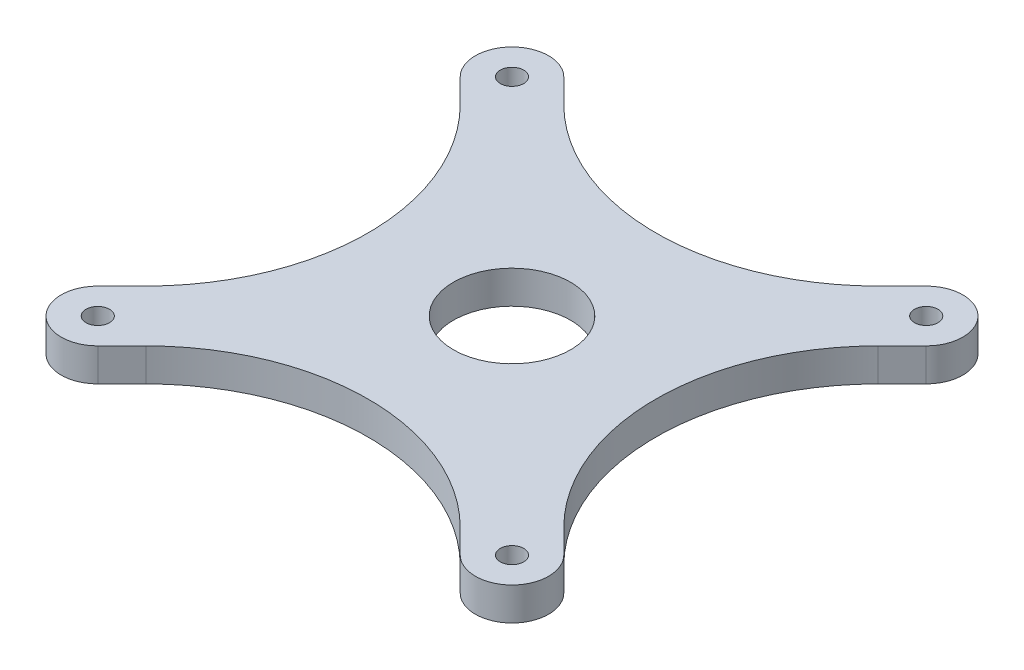
ISO-10303-21;
HEADER;
FILE_DESCRIPTION(('STEP AP214'),'2;1');
FILE_NAME('part.step','',(''),(''),'','','');
FILE_SCHEMA(('AUTOMOTIVE_DESIGN { 1 0 10303 214 1 1 1 1 }'));
ENDSEC;
DATA;
#1=APPLICATION_CONTEXT('core data for automotive mechanical design processes');
#2=APPLICATION_PROTOCOL_DEFINITION('international standard','automotive_design',2000,#1);
#3=PRODUCT_CONTEXT('',#1,'mechanical');
#4=PRODUCT('Part','Part','',(#3));
#5=PRODUCT_RELATED_PRODUCT_CATEGORY('part','',(#4));
#6=PRODUCT_DEFINITION_FORMATION('','',#4);
#7=PRODUCT_DEFINITION_CONTEXT('part definition',#1,'design');
#8=PRODUCT_DEFINITION('design','',#6,#7);
#9=PRODUCT_DEFINITION_SHAPE('','',#8);
#10=(LENGTH_UNIT() NAMED_UNIT(*) SI_UNIT(.MILLI.,.METRE.));
#11=(NAMED_UNIT(*) PLANE_ANGLE_UNIT() SI_UNIT($,.RADIAN.));
#12=(NAMED_UNIT(*) SI_UNIT($,.STERADIAN.) SOLID_ANGLE_UNIT());
#13=UNCERTAINTY_MEASURE_WITH_UNIT(LENGTH_MEASURE(1.E-05),#10,'distance_accuracy_value','');
#14=(GEOMETRIC_REPRESENTATION_CONTEXT(3) GLOBAL_UNCERTAINTY_ASSIGNED_CONTEXT((#13)) GLOBAL_UNIT_ASSIGNED_CONTEXT((#10,
#11,#12)) REPRESENTATION_CONTEXT('',''));
#15=CARTESIAN_POINT('',(0.,0.,0.));
#16=DIRECTION('',(0.,0.,1.));
#17=DIRECTION('',(1.,0.,0.));
#18=AXIS2_PLACEMENT_3D('',#15,#16,#17);
#19=CARTESIAN_POINT('',(-34.9999999999997,5.001,27.9289321881349));
#20=DIRECTION('',(0.707106781186555,0.,0.70710678118654));
#21=DIRECTION('',(0.70710678118654,0.,-0.707106781186555));
#22=AXIS2_PLACEMENT_3D('',#19,#20,#21);
#23=PLANE('',#22);
#24=DIRECTION('',(0.,-1.,0.));
#25=VECTOR('',#24,1.);
#26=CARTESIAN_POINT('',(-28.5355339059325,50.838310227381,21.4644660940676));
#27=LINE('',#26,#25);
#28=CARTESIAN_POINT('',(-28.5355339059325,5.,21.4644660940676));
#29=VERTEX_POINT('',#28);
#30=CARTESIAN_POINT('',(-28.5355339059325,0.5,21.4644660940676));
#31=VERTEX_POINT('',#30);
#32=EDGE_CURVE('E166',#29,#31,#27,.T.);
#33=ORIENTED_EDGE('',*,*,#32,.T.);
#34=DIRECTION('',(-0.70710678118654,0.,0.707106781186555));
#35=VECTOR('',#34,1.);
#36=CARTESIAN_POINT('',(-34.9999999999997,0.5,27.9289321881349));
#37=LINE('',#36,#35);
#38=CARTESIAN_POINT('',(-31.8198051534006,0.5,24.7487373415232));
#39=VERTEX_POINT('',#38);
#40=EDGE_CURVE('E175',#31,#39,#37,.T.);
#41=ORIENTED_EDGE('',*,*,#40,.T.);
#42=DIRECTION('',(0.,-1.,0.));
#43=VECTOR('',#42,1.);
#44=CARTESIAN_POINT('',(-31.8198051534006,5.001,24.7487373415232));
#45=LINE('',#44,#43);
#46=CARTESIAN_POINT('',(-31.8198051534006,5.,24.7487373415358));
#47=VERTEX_POINT('',#46);
#48=EDGE_CURVE('E392',#47,#39,#45,.T.);
#49=ORIENTED_EDGE('',*,*,#48,.F.);
#50=DIRECTION('',(0.70710678118654,0.,-0.707106781186555));
#51=VECTOR('',#50,1.);
#52=CARTESIAN_POINT('',(-34.9999999999997,5.,27.9289321881349));
#53=LINE('',#52,#51);
#54=EDGE_CURVE('E182',#47,#29,#53,.T.);
#55=ORIENTED_EDGE('',*,*,#54,.T.);
#56=EDGE_LOOP('',(#33,#41,#49,#55));
#57=FACE_BOUND('',#56,.T.);
#58=ADVANCED_FACE('F38',(#57),#23,.F.);
#59=CARTESIAN_POINT('',(-27.9289321881348,5.001,-34.9999999999998));
#60=DIRECTION('',(-0.707106781186543,0.,0.707106781186552));
#61=DIRECTION('',(0.707106781186552,0.,0.707106781186543));
#62=AXIS2_PLACEMENT_3D('',#59,#60,#61);
#63=PLANE('',#62);
#64=DIRECTION('',(0.,-1.,0.));
#65=VECTOR('',#64,1.);
#66=CARTESIAN_POINT('',(-21.4644660940675,50.838310227381,-28.5355339059326));
#67=LINE('',#66,#65);
#68=CARTESIAN_POINT('',(-21.4644660940675,5.,-28.5355339059326));
#69=VERTEX_POINT('',#68);
#70=CARTESIAN_POINT('',(-21.4644660940675,0.5,-28.5355339059326));
#71=VERTEX_POINT('',#70);
#72=EDGE_CURVE('E350',#69,#71,#67,.T.);
#73=ORIENTED_EDGE('',*,*,#72,.T.);
#74=DIRECTION('',(-0.707106781186553,0.,-0.707106781186543));
#75=VECTOR('',#74,1.);
#76=CARTESIAN_POINT('',(-27.9289321881348,0.5,-34.9999999999998));
#77=LINE('',#76,#75);
#78=CARTESIAN_POINT('',(-24.7487373415293,0.5,-31.8198051533945));
#79=VERTEX_POINT('',#78);
#80=EDGE_CURVE('E196',#71,#79,#77,.T.);
#81=ORIENTED_EDGE('',*,*,#80,.T.);
#82=DIRECTION('',(0.,-1.,0.));
#83=VECTOR('',#82,1.);
#84=CARTESIAN_POINT('',(-24.7487373415293,5.001,-31.8198051533945));
#85=LINE('',#84,#83);
#86=CARTESIAN_POINT('',(-24.7487373415293,5.,-31.8198051533945));
#87=VERTEX_POINT('',#86);
#88=EDGE_CURVE('E404',#87,#79,#85,.T.);
#89=ORIENTED_EDGE('',*,*,#88,.F.);
#90=DIRECTION('',(0.707106781186552,0.,0.707106781186543));
#91=VECTOR('',#90,1.);
#92=CARTESIAN_POINT('',(-27.9289321881348,5.,-34.9999999999998));
#93=LINE('',#92,#91);
#94=EDGE_CURVE('E203',#87,#69,#93,.T.);
#95=ORIENTED_EDGE('',*,*,#94,.T.);
#96=EDGE_LOOP('',(#73,#81,#89,#95));
#97=FACE_BOUND('',#96,.T.);
#98=ADVANCED_FACE('F282',(#97),#63,.F.);
#99=CARTESIAN_POINT('',(34.9999999999999,5.001,-27.9289321881347));
#100=DIRECTION('',(-0.70710678118655,0.,-0.707106781186545));
#101=DIRECTION('',(-0.707106781186545,0.,0.70710678118655));
#102=AXIS2_PLACEMENT_3D('',#99,#100,#101);
#103=PLANE('',#102);
#104=DIRECTION('',(0.,-1.,0.));
#105=VECTOR('',#104,1.);
#106=CARTESIAN_POINT('',(28.5355339059327,50.838310227381,-21.4644660940674));
#107=LINE('',#106,#105);
#108=CARTESIAN_POINT('',(28.5355339059327,5.,-21.4644660940674));
#109=VERTEX_POINT('',#108);
#110=CARTESIAN_POINT('',(28.5355339059327,0.5,-21.4644660940674));
#111=VERTEX_POINT('',#110);
#112=EDGE_CURVE('E364',#109,#111,#107,.T.);
#113=ORIENTED_EDGE('',*,*,#112,.T.);
#114=DIRECTION('',(0.707106781186545,0.,-0.70710678118655));
#115=VECTOR('',#114,1.);
#116=CARTESIAN_POINT('',(34.9999999999999,0.5,-27.9289321881347));
#117=LINE('',#116,#115);
#118=CARTESIAN_POINT('',(31.8198051534066,0.5,-24.7487373415253));
#119=VERTEX_POINT('',#118);
#120=EDGE_CURVE('E210',#111,#119,#117,.T.);
#121=ORIENTED_EDGE('',*,*,#120,.T.);
#122=DIRECTION('',(0.,-1.,0.));
#123=VECTOR('',#122,1.);
#124=CARTESIAN_POINT('',(31.8198051534066,5.001,-24.7487373415253));
#125=LINE('',#124,#123);
#126=CARTESIAN_POINT('',(31.8198051534066,5.,-24.7487373415253));
#127=VERTEX_POINT('',#126);
#128=EDGE_CURVE('E415',#127,#119,#125,.T.);
#129=ORIENTED_EDGE('',*,*,#128,.F.);
#130=DIRECTION('',(-0.707106781186545,0.,0.70710678118655));
#131=VECTOR('',#130,1.);
#132=CARTESIAN_POINT('',(34.9999999999999,5.,-27.9289321881347));
#133=LINE('',#132,#131);
#134=EDGE_CURVE('E217',#127,#109,#133,.T.);
#135=ORIENTED_EDGE('',*,*,#134,.T.);
#136=EDGE_LOOP('',(#113,#121,#129,#135));
#137=FACE_BOUND('',#136,.T.);
#138=ADVANCED_FACE('F288',(#137),#103,.F.);
#139=CARTESIAN_POINT('',(27.9289321881345,5.001,35.));
#140=DIRECTION('',(0.707106781186547,0.,-0.707106781186547));
#141=DIRECTION('',(-0.707106781186548,0.,-0.707106781186548));
#142=AXIS2_PLACEMENT_3D('',#139,#140,#141);
#143=PLANE('',#142);
#144=DIRECTION('',(0.,-1.,0.));
#145=VECTOR('',#144,1.);
#146=CARTESIAN_POINT('',(21.4644660940673,50.838310227381,28.5355339059327));
#147=LINE('',#146,#145);
#148=CARTESIAN_POINT('',(21.4644660940673,5.,28.5355339059327));
#149=VERTEX_POINT('',#148);
#150=CARTESIAN_POINT('',(21.4644660940673,0.5,28.5355339059327));
#151=VERTEX_POINT('',#150);
#152=EDGE_CURVE('E377',#149,#151,#147,.T.);
#153=ORIENTED_EDGE('',*,*,#152,.T.);
#154=DIRECTION('',(0.707106781186548,0.,0.707106781186548));
#155=VECTOR('',#154,1.);
#156=CARTESIAN_POINT('',(27.9289321881345,0.5,35.));
#157=LINE('',#156,#155);
#158=CARTESIAN_POINT('',(24.7487373415292,0.5,31.8198051533946));
#159=VERTEX_POINT('',#158);
#160=EDGE_CURVE('E224',#151,#159,#157,.T.);
#161=ORIENTED_EDGE('',*,*,#160,.T.);
#162=DIRECTION('',(0.,-1.,0.));
#163=VECTOR('',#162,1.);
#164=CARTESIAN_POINT('',(24.7487373415292,5.001,31.8198051533946));
#165=LINE('',#164,#163);
#166=CARTESIAN_POINT('',(24.7487373415292,5.,31.8198051533946));
#167=VERTEX_POINT('',#166);
#168=EDGE_CURVE('E429',#167,#159,#165,.T.);
#169=ORIENTED_EDGE('',*,*,#168,.F.);
#170=DIRECTION('',(-0.707106781186548,0.,-0.707106781186548));
#171=VECTOR('',#170,1.);
#172=CARTESIAN_POINT('',(27.9289321881345,5.,35.));
#173=LINE('',#172,#171);
#174=EDGE_CURVE('E231',#167,#149,#173,.T.);
#175=ORIENTED_EDGE('',*,*,#174,.T.);
#176=EDGE_LOOP('',(#153,#161,#169,#175));
#177=FACE_BOUND('',#176,.T.);
#178=ADVANCED_FACE('F304',(#177),#143,.F.);
#179=CARTESIAN_POINT('',(-27.9289321881345,5.001,35.));
#180=DIRECTION('',(-0.707106781186547,0.,-0.707106781186547));
#181=DIRECTION('',(-0.707106781186548,0.,0.707106781186548));
#182=AXIS2_PLACEMENT_3D('',#179,#180,#181);
#183=PLANE('',#182);
#184=DIRECTION('',(0.707106781186548,0.,-0.707106781186548));
#185=VECTOR('',#184,1.);
#186=CARTESIAN_POINT('',(-27.9289321881345,0.5,35.));
#187=LINE('',#186,#185);
#188=CARTESIAN_POINT('',(-24.748737341521,0.5,31.8198051533947));
#189=VERTEX_POINT('',#188);
#190=CARTESIAN_POINT('',(-21.4644660940693,0.5,28.5355339059415));
#191=VERTEX_POINT('',#190);
#192=EDGE_CURVE('E227',#189,#191,#187,.T.);
#193=ORIENTED_EDGE('',*,*,#192,.T.);
#194=DIRECTION('',(0.,-1.,0.));
#195=VECTOR('',#194,1.);
#196=CARTESIAN_POINT('',(-21.4644660940693,50.838310227381,28.5355339059415));
#197=LINE('',#196,#195);
#198=CARTESIAN_POINT('',(-21.4644660940693,5.,28.5355339059415));
#199=VERTEX_POINT('',#198);
#200=EDGE_CURVE('E381',#199,#191,#197,.T.);
#201=ORIENTED_EDGE('',*,*,#200,.F.);
#202=DIRECTION('',(-0.707106781186548,0.,0.707106781186548));
#203=VECTOR('',#202,1.);
#204=CARTESIAN_POINT('',(-27.9289321881345,5.,35.));
#205=LINE('',#204,#203);
#206=CARTESIAN_POINT('',(-24.748737341521,5.,31.8198051533947));
#207=VERTEX_POINT('',#206);
#208=EDGE_CURVE('E221',#199,#207,#205,.T.);
#209=ORIENTED_EDGE('',*,*,#208,.T.);
#210=DIRECTION('',(0.,-1.,0.));
#211=VECTOR('',#210,1.);
#212=CARTESIAN_POINT('',(-24.748737341521,5.001,31.8198051533947));
#213=LINE('',#212,#211);
#214=EDGE_CURVE('E393',#207,#189,#213,.T.);
#215=ORIENTED_EDGE('',*,*,#214,.T.);
#216=EDGE_LOOP('',(#193,#201,#209,#215));
#217=FACE_BOUND('',#216,.T.);
#218=ADVANCED_FACE('F306',(#217),#183,.F.);
#219=CARTESIAN_POINT('',(-35.0000000000003,5.001,-27.9289321881342));
#220=DIRECTION('',(0.70710678118654,0.,-0.707106781186555));
#221=DIRECTION('',(-0.707106781186555,0.,-0.70710678118654));
#222=AXIS2_PLACEMENT_3D('',#219,#220,#221);
#223=PLANE('',#222);
#224=DIRECTION('',(0.707106781186555,0.,0.70710678118654));
#225=VECTOR('',#224,1.);
#226=CARTESIAN_POINT('',(-35.0000000000003,0.5,-27.9289321881342));
#227=LINE('',#226,#225);
#228=CARTESIAN_POINT('',(-31.8198051533949,0.5,-24.7487373415288));
#229=VERTEX_POINT('',#228);
#230=CARTESIAN_POINT('',(-28.5355339059417,0.5,-21.4644660940691));
#231=VERTEX_POINT('',#230);
#232=EDGE_CURVE('E173',#229,#231,#227,.T.);
#233=ORIENTED_EDGE('',*,*,#232,.T.);
#234=DIRECTION('',(0.,-1.,0.));
#235=VECTOR('',#234,1.);
#236=CARTESIAN_POINT('',(-28.5355339059417,50.838310227381,-21.4644660940691));
#237=LINE('',#236,#235);
#238=CARTESIAN_POINT('',(-28.5355339059417,5.,-21.4644660940691));
#239=VERTEX_POINT('',#238);
#240=EDGE_CURVE('E155',#239,#231,#237,.T.);
#241=ORIENTED_EDGE('',*,*,#240,.F.);
#242=DIRECTION('',(-0.707106781186555,0.,-0.70710678118654));
#243=VECTOR('',#242,1.);
#244=CARTESIAN_POINT('',(-35.0000000000003,5.,-27.9289321881342));
#245=LINE('',#244,#243);
#246=CARTESIAN_POINT('',(-31.8198051533949,5.,-24.7487373415288));
#247=VERTEX_POINT('',#246);
#248=EDGE_CURVE('E190',#239,#247,#245,.T.);
#249=ORIENTED_EDGE('',*,*,#248,.T.);
#250=DIRECTION('',(0.,-1.,0.));
#251=VECTOR('',#250,1.);
#252=CARTESIAN_POINT('',(-31.8198051533949,5.001,-24.7487373415288));
#253=LINE('',#252,#251);
#254=EDGE_CURVE('E180',#247,#229,#253,.T.);
#255=ORIENTED_EDGE('',*,*,#254,.T.);
#256=EDGE_LOOP('',(#233,#241,#249,#255));
#257=FACE_BOUND('',#256,.T.);
#258=ADVANCED_FACE('F179',(#257),#223,.F.);
#259=CARTESIAN_POINT('',(27.9289321881343,5.001,-35.0000000000002));
#260=DIRECTION('',(0.707106781186552,0.,0.707106781186543));
#261=DIRECTION('',(0.707106781186543,0.,-0.707106781186552));
#262=AXIS2_PLACEMENT_3D('',#259,#260,#261);
#263=PLANE('',#262);
#264=DIRECTION('',(-0.707106781186543,0.,0.707106781186552));
#265=VECTOR('',#264,1.);
#266=CARTESIAN_POINT('',(27.9289321881343,0.5,-35.0000000000002));
#267=LINE('',#266,#265);
#268=CARTESIAN_POINT('',(24.7487373415286,0.5,-31.8198051533945));
#269=VERTEX_POINT('',#268);
#270=CARTESIAN_POINT('',(21.4644660940692,0.5,-28.5355339059416));
#271=VERTEX_POINT('',#270);
#272=EDGE_CURVE('E199',#269,#271,#267,.T.);
#273=ORIENTED_EDGE('',*,*,#272,.T.);
#274=DIRECTION('',(0.,-1.,0.));
#275=VECTOR('',#274,1.);
#276=CARTESIAN_POINT('',(21.4644660940692,50.838310227381,-28.5355339059416));
#277=LINE('',#276,#275);
#278=CARTESIAN_POINT('',(21.4644660940692,5.,-28.5355339059416));
#279=VERTEX_POINT('',#278);
#280=EDGE_CURVE('E354',#279,#271,#277,.T.);
#281=ORIENTED_EDGE('',*,*,#280,.F.);
#282=DIRECTION('',(0.707106781186543,0.,-0.707106781186552));
#283=VECTOR('',#282,1.);
#284=CARTESIAN_POINT('',(27.9289321881343,5.,-35.0000000000002));
#285=LINE('',#284,#283);
#286=CARTESIAN_POINT('',(24.7487373415286,5.,-31.8198051534028));
#287=VERTEX_POINT('',#286);
#288=EDGE_CURVE('E187',#279,#287,#285,.T.);
#289=ORIENTED_EDGE('',*,*,#288,.T.);
#290=DIRECTION('',(0.,-1.,0.));
#291=VECTOR('',#290,1.);
#292=CARTESIAN_POINT('',(24.7487373415286,5.001,-31.8198051534028));
#293=LINE('',#292,#291);
#294=EDGE_CURVE('E416',#287,#269,#293,.T.);
#295=ORIENTED_EDGE('',*,*,#294,.T.);
#296=EDGE_LOOP('',(#273,#281,#289,#295));
#297=FACE_BOUND('',#296,.T.);
#298=ADVANCED_FACE('F294',(#297),#263,.F.);
#299=CARTESIAN_POINT('',(35.0000000000001,5.001,27.9289321881344));
#300=DIRECTION('',(-0.707106781186545,0.,0.70710678118655));
#301=DIRECTION('',(0.70710678118655,0.,0.707106781186545));
#302=AXIS2_PLACEMENT_3D('',#299,#300,#301);
#303=PLANE('',#302);
#304=DIRECTION('',(-0.70710678118655,0.,-0.707106781186545));
#305=VECTOR('',#304,1.);
#306=CARTESIAN_POINT('',(35.0000000000001,0.5,27.9289321881344));
#307=LINE('',#306,#305);
#308=CARTESIAN_POINT('',(31.8198051533905,0.5,24.7487373415249));
#309=VERTEX_POINT('',#308);
#310=CARTESIAN_POINT('',(28.5355339059415,0.5,21.4644660940693));
#311=VERTEX_POINT('',#310);
#312=EDGE_CURVE('E213',#309,#311,#307,.T.);
#313=ORIENTED_EDGE('',*,*,#312,.T.);
#314=DIRECTION('',(0.,-1.,0.));
#315=VECTOR('',#314,1.);
#316=CARTESIAN_POINT('',(28.5355339059415,50.838310227381,21.4644660940693));
#317=LINE('',#316,#315);
#318=CARTESIAN_POINT('',(28.5355339059415,5.,21.4644660940693));
#319=VERTEX_POINT('',#318);
#320=EDGE_CURVE('E368',#319,#311,#317,.T.);
#321=ORIENTED_EDGE('',*,*,#320,.F.);
#322=DIRECTION('',(0.70710678118655,0.,0.707106781186545));
#323=VECTOR('',#322,1.);
#324=CARTESIAN_POINT('',(35.0000000000001,5.,27.9289321881344));
#325=LINE('',#324,#323);
#326=CARTESIAN_POINT('',(31.8198051533985,5.,24.7487373415249));
#327=VERTEX_POINT('',#326);
#328=EDGE_CURVE('E207',#319,#327,#325,.T.);
#329=ORIENTED_EDGE('',*,*,#328,.T.);
#330=DIRECTION('',(0.,-1.,0.));
#331=VECTOR('',#330,1.);
#332=CARTESIAN_POINT('',(31.8198051533985,5.001,24.7487373415249));
#333=LINE('',#332,#331);
#334=EDGE_CURVE('E430',#327,#309,#333,.T.);
#335=ORIENTED_EDGE('',*,*,#334,.T.);
#336=EDGE_LOOP('',(#313,#321,#329,#335));
#337=FACE_BOUND('',#336,.T.);
#338=ADVANCED_FACE('F296',(#337),#303,.F.);
#339=CARTESIAN_POINT('',(0.,5.,0.));
#340=DIRECTION('',(0.,-1.,0.));
#341=DIRECTION('',(0.,0.,-1.));
#342=AXIS2_PLACEMENT_3D('',#339,#340,#341);
#343=PLANE('',#342);
#344=ORIENTED_EDGE('',*,*,#248,.F.);
#345=CARTESIAN_POINT('',(-50.,5.,5.21987477350493E-13));
#346=DIRECTION('',(0.,-1.,0.));
#347=DIRECTION('',(0.,0.,-1.));
#348=AXIS2_PLACEMENT_3D('',#345,#346,#347);
#349=CIRCLE('',#348,30.355339059325);
#350=EDGE_CURVE('E161',#239,#29,#349,.T.);
#351=ORIENTED_EDGE('',*,*,#350,.T.);
#352=ORIENTED_EDGE('',*,*,#54,.F.);
#353=CARTESIAN_POINT('',(-28.2842712474621,5.,28.284271247454));
#354=DIRECTION('',(0.,-1.,0.));
#355=DIRECTION('',(0.,0.,-1.));
#356=AXIS2_PLACEMENT_3D('',#353,#354,#355);
#357=CIRCLE('',#356,5.00000000000272);
#358=EDGE_CURVE('E54',#207,#47,#357,.T.);
#359=ORIENTED_EDGE('',*,*,#358,.F.);
#360=ORIENTED_EDGE('',*,*,#208,.F.);
#361=CARTESIAN_POINT('',(0.,5.,50.));
#362=DIRECTION('',(0.,-1.,0.));
#363=DIRECTION('',(0.,0.,-1.));
#364=AXIS2_PLACEMENT_3D('',#361,#362,#363);
#365=CIRCLE('',#364,30.355339059325);
#366=EDGE_CURVE('E374',#199,#149,#365,.T.);
#367=ORIENTED_EDGE('',*,*,#366,.T.);
#368=ORIENTED_EDGE('',*,*,#174,.F.);
#369=CARTESIAN_POINT('',(28.2842712474619,5.,28.2842712474619));
#370=DIRECTION('',(0.,-1.,0.));
#371=DIRECTION('',(0.,0.,-1.));
#372=AXIS2_PLACEMENT_3D('',#369,#370,#371);
#373=CIRCLE('',#372,5.00000000000578);
#374=EDGE_CURVE('E420',#327,#167,#373,.T.);
#375=ORIENTED_EDGE('',*,*,#374,.F.);
#376=ORIENTED_EDGE('',*,*,#328,.F.);
#377=CARTESIAN_POINT('',(50.,5.,-1.74574066942157E-13));
#378=DIRECTION('',(0.,-1.,0.));
#379=DIRECTION('',(0.,0.,-1.));
#380=AXIS2_PLACEMENT_3D('',#377,#378,#379);
#381=CIRCLE('',#380,30.355339059325);
#382=EDGE_CURVE('E360',#319,#109,#381,.T.);
#383=ORIENTED_EDGE('',*,*,#382,.T.);
#384=ORIENTED_EDGE('',*,*,#134,.F.);
#385=CARTESIAN_POINT('',(28.2842712474697,5.,-28.2842712474621));
#386=DIRECTION('',(0.,-1.,0.));
#387=DIRECTION('',(0.,0.,-1.));
#388=AXIS2_PLACEMENT_3D('',#385,#386,#387);
#389=CIRCLE('',#388,5.00000000000578);
#390=EDGE_CURVE('E407',#287,#127,#389,.T.);
#391=ORIENTED_EDGE('',*,*,#390,.F.);
#392=ORIENTED_EDGE('',*,*,#288,.F.);
#393=CARTESIAN_POINT('',(-3.49148133884313E-13,5.,-50.));
#394=DIRECTION('',(0.,-1.,0.));
#395=DIRECTION('',(0.,0.,-1.));
#396=AXIS2_PLACEMENT_3D('',#393,#394,#395);
#397=CIRCLE('',#396,30.355339059325);
#398=EDGE_CURVE('E346',#279,#69,#397,.T.);
#399=ORIENTED_EDGE('',*,*,#398,.T.);
#400=ORIENTED_EDGE('',*,*,#94,.F.);
#401=CARTESIAN_POINT('',(-28.2842712474621,5.,-28.2842712474617));
#402=DIRECTION('',(0.,-1.,0.));
#403=DIRECTION('',(0.,0.,-1.));
#404=AXIS2_PLACEMENT_3D('',#401,#402,#403);
#405=CIRCLE('',#404,5.00000000000007);
#406=EDGE_CURVE('E397',#247,#87,#405,.T.);
#407=ORIENTED_EDGE('',*,*,#406,.F.);
#408=EDGE_LOOP('',(#344,#351,#352,#359,#360,#367,#368,#375,#376,#383,#384,#391,#392,#399,#400,#407));
#409=FACE_BOUND('',#408,.T.);
#410=CARTESIAN_POINT('',(28.2842712474619,5.,-28.2842712474619));
#411=DIRECTION('',(0.,1.,0.));
#412=DIRECTION('',(0.,0.,1.));
#413=AXIS2_PLACEMENT_3D('',#410,#411,#412);
#414=CIRCLE('',#413,1.6);
#415=CARTESIAN_POINT('',(28.2842712474619,5.,-26.6842712474619));
#416=VERTEX_POINT('',#415);
#417=EDGE_CURVE('E235',#416,#416,#414,.T.);
#418=ORIENTED_EDGE('',*,*,#417,.F.);
#419=EDGE_LOOP('',(#418));
#420=FACE_BOUND('',#419,.T.);
#421=CARTESIAN_POINT('',(-28.2842712474619,5.,-28.2842712474619));
#422=DIRECTION('',(0.,1.,0.));
#423=DIRECTION('',(0.,0.,1.));
#424=AXIS2_PLACEMENT_3D('',#421,#422,#423);
#425=CIRCLE('',#424,1.6);
#426=CARTESIAN_POINT('',(-28.2842712474619,5.,-26.6842712474619));
#427=VERTEX_POINT('',#426);
#428=EDGE_CURVE('E243',#427,#427,#425,.T.);
#429=ORIENTED_EDGE('',*,*,#428,.F.);
#430=EDGE_LOOP('',(#429));
#431=FACE_BOUND('',#430,.T.);
#432=CARTESIAN_POINT('',(-28.2842712474619,5.,28.2842712474619));
#433=DIRECTION('',(0.,1.,0.));
#434=DIRECTION('',(0.,0.,1.));
#435=AXIS2_PLACEMENT_3D('',#432,#433,#434);
#436=CIRCLE('',#435,1.6);
#437=CARTESIAN_POINT('',(-28.2842712474619,5.,29.8842712474619));
#438=VERTEX_POINT('',#437);
#439=EDGE_CURVE('E251',#438,#438,#436,.T.);
#440=ORIENTED_EDGE('',*,*,#439,.F.);
#441=EDGE_LOOP('',(#440));
#442=FACE_BOUND('',#441,.T.);
#443=CARTESIAN_POINT('',(28.2842712474619,5.,28.2842712474619));
#444=DIRECTION('',(0.,1.,0.));
#445=DIRECTION('',(0.,0.,1.));
#446=AXIS2_PLACEMENT_3D('',#443,#444,#445);
#447=CIRCLE('',#446,1.6);
#448=CARTESIAN_POINT('',(28.2842712474619,5.,29.8842712474619));
#449=VERTEX_POINT('',#448);
#450=EDGE_CURVE('E259',#449,#449,#447,.T.);
#451=ORIENTED_EDGE('',*,*,#450,.F.);
#452=EDGE_LOOP('',(#451));
#453=FACE_BOUND('',#452,.T.);
#454=CARTESIAN_POINT('',(0.,5.,0.));
#455=DIRECTION('',(0.,1.,0.));
#456=DIRECTION('',(0.,0.,1.));
#457=AXIS2_PLACEMENT_3D('',#454,#455,#456);
#458=CIRCLE('',#457,8.);
#459=CARTESIAN_POINT('',(0.,5.,8.));
#460=VERTEX_POINT('',#459);
#461=EDGE_CURVE('E11',#460,#460,#458,.T.);
#462=ORIENTED_EDGE('',*,*,#461,.F.);
#463=EDGE_LOOP('',(#462));
#464=FACE_BOUND('',#463,.T.);
#465=ADVANCED_FACE('F40',(#409,#420,#431,#442,#453,#464),#343,.F.);
#466=CARTESIAN_POINT('',(0.,2.5,0.));
#467=DIRECTION('',(0.,1.,0.));
#468=DIRECTION('',(0.,0.,1.));
#469=AXIS2_PLACEMENT_3D('',#466,#467,#468);
#470=CYLINDRICAL_SURFACE('',#469,8.);
#471=ORIENTED_EDGE('',*,*,#461,.T.);
#472=EDGE_LOOP('',(#471));
#473=FACE_BOUND('',#472,.T.);
#474=CARTESIAN_POINT('',(0.,0.5,0.));
#475=DIRECTION('',(0.,1.,0.));
#476=DIRECTION('',(0.,0.,1.));
#477=AXIS2_PLACEMENT_3D('',#474,#475,#476);
#478=CIRCLE('',#477,8.);
#479=CARTESIAN_POINT('',(0.,0.5,8.));
#480=VERTEX_POINT('',#479);
#481=EDGE_CURVE('E177',#480,#480,#478,.F.);
#482=ORIENTED_EDGE('',*,*,#481,.T.);
#483=EDGE_LOOP('',(#482));
#484=FACE_BOUND('',#483,.T.);
#485=ADVANCED_FACE('F269',(#473,#484),#470,.F.);
#486=CARTESIAN_POINT('',(0.,0.5,0.));
#487=DIRECTION('',(0.,1.,0.));
#488=DIRECTION('',(0.,0.,1.));
#489=AXIS2_PLACEMENT_3D('',#486,#487,#488);
#490=PLANE('',#489);
#491=ORIENTED_EDGE('',*,*,#481,.F.);
#492=EDGE_LOOP('',(#491));
#493=FACE_BOUND('',#492,.T.);
#494=ORIENTED_EDGE('',*,*,#40,.F.);
#495=CARTESIAN_POINT('',(-50.,0.5,5.21987477350493E-13));
#496=DIRECTION('',(0.,1.,0.));
#497=DIRECTION('',(0.,0.,-1.));
#498=AXIS2_PLACEMENT_3D('',#495,#496,#497);
#499=CIRCLE('',#498,30.355339059325);
#500=EDGE_CURVE('E159',#31,#231,#499,.T.);
#501=ORIENTED_EDGE('',*,*,#500,.T.);
#502=ORIENTED_EDGE('',*,*,#232,.F.);
#503=CARTESIAN_POINT('',(-28.2842712474621,0.5,-28.2842712474617));
#504=DIRECTION('',(0.,1.,0.));
#505=DIRECTION('',(0.,0.,-1.));
#506=AXIS2_PLACEMENT_3D('',#503,#504,#505);
#507=CIRCLE('',#506,5.00000000000007);
#508=EDGE_CURVE('E62',#79,#229,#507,.T.);
#509=ORIENTED_EDGE('',*,*,#508,.F.);
#510=ORIENTED_EDGE('',*,*,#80,.F.);
#511=CARTESIAN_POINT('',(-3.49148133884313E-13,0.5,-50.));
#512=DIRECTION('',(0.,1.,0.));
#513=DIRECTION('',(0.,0.,-1.));
#514=AXIS2_PLACEMENT_3D('',#511,#512,#513);
#515=CIRCLE('',#514,30.355339059325);
#516=EDGE_CURVE('E342',#71,#271,#515,.T.);
#517=ORIENTED_EDGE('',*,*,#516,.T.);
#518=ORIENTED_EDGE('',*,*,#272,.F.);
#519=CARTESIAN_POINT('',(28.2842712474697,0.5,-28.2842712474621));
#520=DIRECTION('',(0.,1.,0.));
#521=DIRECTION('',(0.,0.,-1.));
#522=AXIS2_PLACEMENT_3D('',#519,#520,#521);
#523=CIRCLE('',#522,5.00000000000578);
#524=EDGE_CURVE('E412',#119,#269,#523,.T.);
#525=ORIENTED_EDGE('',*,*,#524,.F.);
#526=ORIENTED_EDGE('',*,*,#120,.F.);
#527=CARTESIAN_POINT('',(50.,0.5,-1.74574066942157E-13));
#528=DIRECTION('',(0.,1.,0.));
#529=DIRECTION('',(0.,0.,-1.));
#530=AXIS2_PLACEMENT_3D('',#527,#528,#529);
#531=CIRCLE('',#530,30.355339059325);
#532=EDGE_CURVE('E349',#111,#311,#531,.T.);
#533=ORIENTED_EDGE('',*,*,#532,.T.);
#534=ORIENTED_EDGE('',*,*,#312,.F.);
#535=CARTESIAN_POINT('',(28.2842712474619,0.5,28.2842712474619));
#536=DIRECTION('',(0.,1.,0.));
#537=DIRECTION('',(0.,0.,-1.));
#538=AXIS2_PLACEMENT_3D('',#535,#536,#537);
#539=CIRCLE('',#538,5.00000000000578);
#540=EDGE_CURVE('E426',#159,#309,#539,.T.);
#541=ORIENTED_EDGE('',*,*,#540,.F.);
#542=ORIENTED_EDGE('',*,*,#160,.F.);
#543=CARTESIAN_POINT('',(0.,0.5,50.));
#544=DIRECTION('',(0.,1.,0.));
#545=DIRECTION('',(0.,0.,-1.));
#546=AXIS2_PLACEMENT_3D('',#543,#544,#545);
#547=CIRCLE('',#546,30.355339059325);
#548=EDGE_CURVE('E363',#151,#191,#547,.T.);
#549=ORIENTED_EDGE('',*,*,#548,.T.);
#550=ORIENTED_EDGE('',*,*,#192,.F.);
#551=CARTESIAN_POINT('',(-28.2842712474621,0.5,28.284271247454));
#552=DIRECTION('',(0.,1.,0.));
#553=DIRECTION('',(0.,0.,-1.));
#554=AXIS2_PLACEMENT_3D('',#551,#552,#553);
#555=CIRCLE('',#554,5.00000000000272);
#556=EDGE_CURVE('E389',#39,#189,#555,.T.);
#557=ORIENTED_EDGE('',*,*,#556,.F.);
#558=EDGE_LOOP('',(#494,#501,#502,#509,#510,#517,#518,#525,#526,#533,#534,#541,#542,#549,#550,#557));
#559=FACE_BOUND('',#558,.T.);
#560=CARTESIAN_POINT('',(28.2842712474619,0.5,-28.2842712474619));
#561=DIRECTION('',(0.,1.,0.));
#562=DIRECTION('',(0.,0.,1.));
#563=AXIS2_PLACEMENT_3D('',#560,#561,#562);
#564=CIRCLE('',#563,1.6);
#565=CARTESIAN_POINT('',(28.2842712474619,0.5,-26.6842712474619));
#566=VERTEX_POINT('',#565);
#567=EDGE_CURVE('E239',#566,#566,#564,.F.);
#568=ORIENTED_EDGE('',*,*,#567,.F.);
#569=EDGE_LOOP('',(#568));
#570=FACE_BOUND('',#569,.T.);
#571=CARTESIAN_POINT('',(-28.2842712474619,0.5,-28.2842712474619));
#572=DIRECTION('',(0.,1.,0.));
#573=DIRECTION('',(0.,0.,1.));
#574=AXIS2_PLACEMENT_3D('',#571,#572,#573);
#575=CIRCLE('',#574,1.6);
#576=CARTESIAN_POINT('',(-28.2842712474619,0.5,-26.6842712474619));
#577=VERTEX_POINT('',#576);
#578=EDGE_CURVE('E247',#577,#577,#575,.F.);
#579=ORIENTED_EDGE('',*,*,#578,.F.);
#580=EDGE_LOOP('',(#579));
#581=FACE_BOUND('',#580,.T.);
#582=CARTESIAN_POINT('',(-28.2842712474619,0.5,28.2842712474619));
#583=DIRECTION('',(0.,1.,0.));
#584=DIRECTION('',(0.,0.,1.));
#585=AXIS2_PLACEMENT_3D('',#582,#583,#584);
#586=CIRCLE('',#585,1.6);
#587=CARTESIAN_POINT('',(-28.2842712474619,0.5,29.8842712474619));
#588=VERTEX_POINT('',#587);
#589=EDGE_CURVE('E255',#588,#588,#586,.F.);
#590=ORIENTED_EDGE('',*,*,#589,.F.);
#591=EDGE_LOOP('',(#590));
#592=FACE_BOUND('',#591,.T.);
#593=CARTESIAN_POINT('',(28.2842712474619,0.5,28.2842712474619));
#594=DIRECTION('',(0.,1.,0.));
#595=DIRECTION('',(0.,0.,1.));
#596=AXIS2_PLACEMENT_3D('',#593,#594,#595);
#597=CIRCLE('',#596,1.6);
#598=CARTESIAN_POINT('',(28.2842712474619,0.5,29.8842712474619));
#599=VERTEX_POINT('',#598);
#600=EDGE_CURVE('E47',#599,#599,#597,.F.);
#601=ORIENTED_EDGE('',*,*,#600,.F.);
#602=EDGE_LOOP('',(#601));
#603=FACE_BOUND('',#602,.T.);
#604=ADVANCED_FACE('F171',(#493,#559,#570,#581,#592,#603),#490,.F.);
#605=CARTESIAN_POINT('',(28.2842712474619,-0.00100000000000013,28.2842712474619));
#606=DIRECTION('',(0.,1.,0.));
#607=DIRECTION('',(0.,0.,1.));
#608=AXIS2_PLACEMENT_3D('',#605,#606,#607);
#609=CYLINDRICAL_SURFACE('',#608,1.6);
#610=ORIENTED_EDGE('',*,*,#450,.T.);
#611=EDGE_LOOP('',(#610));
#612=FACE_BOUND('',#611,.T.);
#613=ORIENTED_EDGE('',*,*,#600,.T.);
#614=EDGE_LOOP('',(#613));
#615=FACE_BOUND('',#614,.T.);
#616=ADVANCED_FACE('F266',(#612,#615),#609,.F.);
#617=CARTESIAN_POINT('',(-28.2842712474619,-0.00100000000000013,28.2842712474619));
#618=DIRECTION('',(0.,1.,0.));
#619=DIRECTION('',(0.,0.,1.));
#620=AXIS2_PLACEMENT_3D('',#617,#618,#619);
#621=CYLINDRICAL_SURFACE('',#620,1.6);
#622=ORIENTED_EDGE('',*,*,#439,.T.);
#623=EDGE_LOOP('',(#622));
#624=FACE_BOUND('',#623,.T.);
#625=ORIENTED_EDGE('',*,*,#589,.T.);
#626=EDGE_LOOP('',(#625));
#627=FACE_BOUND('',#626,.T.);
#628=ADVANCED_FACE('F276',(#624,#627),#621,.F.);
#629=CARTESIAN_POINT('',(-28.2842712474619,-0.00100000000000013,-28.2842712474619));
#630=DIRECTION('',(0.,1.,0.));
#631=DIRECTION('',(0.,0.,1.));
#632=AXIS2_PLACEMENT_3D('',#629,#630,#631);
#633=CYLINDRICAL_SURFACE('',#632,1.6);
#634=ORIENTED_EDGE('',*,*,#428,.T.);
#635=EDGE_LOOP('',(#634));
#636=FACE_BOUND('',#635,.T.);
#637=ORIENTED_EDGE('',*,*,#578,.T.);
#638=EDGE_LOOP('',(#637));
#639=FACE_BOUND('',#638,.T.);
#640=ADVANCED_FACE('F317',(#636,#639),#633,.F.);
#641=CARTESIAN_POINT('',(28.2842712474619,-0.00100000000000013,-28.2842712474619));
#642=DIRECTION('',(0.,1.,0.));
#643=DIRECTION('',(0.,0.,1.));
#644=AXIS2_PLACEMENT_3D('',#641,#642,#643);
#645=CYLINDRICAL_SURFACE('',#644,1.6);
#646=ORIENTED_EDGE('',*,*,#417,.T.);
#647=EDGE_LOOP('',(#646));
#648=FACE_BOUND('',#647,.T.);
#649=ORIENTED_EDGE('',*,*,#567,.T.);
#650=EDGE_LOOP('',(#649));
#651=FACE_BOUND('',#650,.T.);
#652=ADVANCED_FACE('F313',(#648,#651),#645,.F.);
#653=CARTESIAN_POINT('',(28.2842712474619,5.001,28.2842712474619));
#654=DIRECTION('',(0.,-1.,0.));
#655=DIRECTION('',(0.,0.,-1.));
#656=AXIS2_PLACEMENT_3D('',#653,#654,#655);
#657=CYLINDRICAL_SURFACE('',#656,5.00000000000578);
#658=ORIENTED_EDGE('',*,*,#374,.T.);
#659=ORIENTED_EDGE('',*,*,#168,.T.);
#660=ORIENTED_EDGE('',*,*,#540,.T.);
#661=ORIENTED_EDGE('',*,*,#334,.F.);
#662=EDGE_LOOP('',(#658,#659,#660,#661));
#663=FACE_BOUND('',#662,.T.);
#664=ADVANCED_FACE('F316',(#663),#657,.T.);
#665=CARTESIAN_POINT('',(28.2842712474697,5.001,-28.2842712474621));
#666=DIRECTION('',(0.,-1.,0.));
#667=DIRECTION('',(0.,0.,-1.));
#668=AXIS2_PLACEMENT_3D('',#665,#666,#667);
#669=CYLINDRICAL_SURFACE('',#668,5.00000000000578);
#670=ORIENTED_EDGE('',*,*,#390,.T.);
#671=ORIENTED_EDGE('',*,*,#128,.T.);
#672=ORIENTED_EDGE('',*,*,#524,.T.);
#673=ORIENTED_EDGE('',*,*,#294,.F.);
#674=EDGE_LOOP('',(#670,#671,#672,#673));
#675=FACE_BOUND('',#674,.T.);
#676=ADVANCED_FACE('F452',(#675),#669,.T.);
#677=CARTESIAN_POINT('',(-28.2842712474621,5.001,-28.2842712474617));
#678=DIRECTION('',(0.,-1.,0.));
#679=DIRECTION('',(0.,0.,-1.));
#680=AXIS2_PLACEMENT_3D('',#677,#678,#679);
#681=CYLINDRICAL_SURFACE('',#680,5.00000000000007);
#682=ORIENTED_EDGE('',*,*,#406,.T.);
#683=ORIENTED_EDGE('',*,*,#88,.T.);
#684=ORIENTED_EDGE('',*,*,#508,.T.);
#685=ORIENTED_EDGE('',*,*,#254,.F.);
#686=EDGE_LOOP('',(#682,#683,#684,#685));
#687=FACE_BOUND('',#686,.T.);
#688=ADVANCED_FACE('F438',(#687),#681,.T.);
#689=CARTESIAN_POINT('',(-28.2842712474621,5.001,28.284271247454));
#690=DIRECTION('',(0.,-1.,0.));
#691=DIRECTION('',(0.,0.,-1.));
#692=AXIS2_PLACEMENT_3D('',#689,#690,#691);
#693=CYLINDRICAL_SURFACE('',#692,5.00000000000272);
#694=ORIENTED_EDGE('',*,*,#358,.T.);
#695=ORIENTED_EDGE('',*,*,#48,.T.);
#696=ORIENTED_EDGE('',*,*,#556,.T.);
#697=ORIENTED_EDGE('',*,*,#214,.F.);
#698=EDGE_LOOP('',(#694,#695,#696,#697));
#699=FACE_BOUND('',#698,.T.);
#700=ADVANCED_FACE('F473',(#699),#693,.T.);
#701=CARTESIAN_POINT('',(0.,50.838310227381,50.));
#702=DIRECTION('',(0.,-1.,0.));
#703=DIRECTION('',(0.,0.,-1.));
#704=AXIS2_PLACEMENT_3D('',#701,#702,#703);
#705=CYLINDRICAL_SURFACE('',#704,30.355339059325);
#706=ORIENTED_EDGE('',*,*,#366,.F.);
#707=ORIENTED_EDGE('',*,*,#200,.T.);
#708=ORIENTED_EDGE('',*,*,#548,.F.);
#709=ORIENTED_EDGE('',*,*,#152,.F.);
#710=EDGE_LOOP('',(#706,#707,#708,#709));
#711=FACE_BOUND('',#710,.T.);
#712=ADVANCED_FACE('F476',(#711),#705,.F.);
#713=CARTESIAN_POINT('',(50.,50.838310227381,-1.74574066942157E-13));
#714=DIRECTION('',(0.,-1.,0.));
#715=DIRECTION('',(0.,0.,-1.));
#716=AXIS2_PLACEMENT_3D('',#713,#714,#715);
#717=CYLINDRICAL_SURFACE('',#716,30.355339059325);
#718=ORIENTED_EDGE('',*,*,#382,.F.);
#719=ORIENTED_EDGE('',*,*,#320,.T.);
#720=ORIENTED_EDGE('',*,*,#532,.F.);
#721=ORIENTED_EDGE('',*,*,#112,.F.);
#722=EDGE_LOOP('',(#718,#719,#720,#721));
#723=FACE_BOUND('',#722,.T.);
#724=ADVANCED_FACE('F482',(#723),#717,.F.);
#725=CARTESIAN_POINT('',(-3.49148133884313E-13,50.838310227381,-50.));
#726=DIRECTION('',(0.,-1.,0.));
#727=DIRECTION('',(0.,0.,-1.));
#728=AXIS2_PLACEMENT_3D('',#725,#726,#727);
#729=CYLINDRICAL_SURFACE('',#728,30.355339059325);
#730=ORIENTED_EDGE('',*,*,#398,.F.);
#731=ORIENTED_EDGE('',*,*,#280,.T.);
#732=ORIENTED_EDGE('',*,*,#516,.F.);
#733=ORIENTED_EDGE('',*,*,#72,.F.);
#734=EDGE_LOOP('',(#730,#731,#732,#733));
#735=FACE_BOUND('',#734,.T.);
#736=ADVANCED_FACE('F516',(#735),#729,.F.);
#737=CARTESIAN_POINT('',(-50.,50.838310227381,5.21987477350493E-13));
#738=DIRECTION('',(0.,-1.,0.));
#739=DIRECTION('',(0.,0.,-1.));
#740=AXIS2_PLACEMENT_3D('',#737,#738,#739);
#741=CYLINDRICAL_SURFACE('',#740,30.355339059325);
#742=ORIENTED_EDGE('',*,*,#350,.F.);
#743=ORIENTED_EDGE('',*,*,#240,.T.);
#744=ORIENTED_EDGE('',*,*,#500,.F.);
#745=ORIENTED_EDGE('',*,*,#32,.F.);
#746=EDGE_LOOP('',(#742,#743,#744,#745));
#747=FACE_BOUND('',#746,.T.);
#748=ADVANCED_FACE('F157',(#747),#741,.F.);
#749=CLOSED_SHELL('',(#58,#98,#138,#178,#218,#258,#298,#338,#465,#485,#604,#616,#628,#640,#652,
#664,#676,#688,#700,#712,#724,#736,#748));
#750=MANIFOLD_SOLID_BREP('B2',#749);
#751=ADVANCED_BREP_SHAPE_REPRESENTATION('',(#18,#750),#14);
#752=SHAPE_DEFINITION_REPRESENTATION(#9,#751);
ENDSEC;
END-ISO-10303-21;
